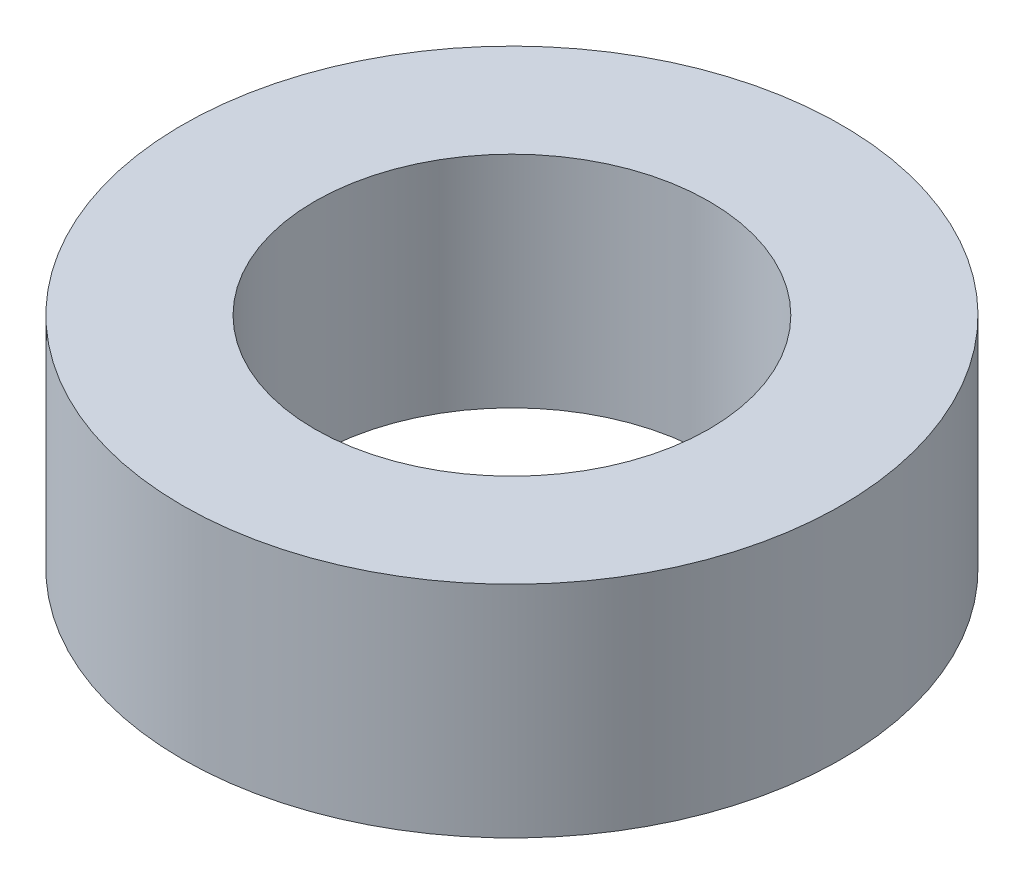
ISO-10303-21;
HEADER;
FILE_DESCRIPTION(('STEP AP214'),'2;1');
FILE_NAME('part.step','',(''),(''),'','','');
FILE_SCHEMA(('AUTOMOTIVE_DESIGN { 1 0 10303 214 1 1 1 1 }'));
ENDSEC;
DATA;
#1=APPLICATION_CONTEXT('core data for automotive mechanical design processes');
#2=APPLICATION_PROTOCOL_DEFINITION('international standard','automotive_design',2000,#1);
#3=PRODUCT_CONTEXT('',#1,'mechanical');
#4=PRODUCT('Part','Part','',(#3));
#5=PRODUCT_RELATED_PRODUCT_CATEGORY('part','',(#4));
#6=PRODUCT_DEFINITION_FORMATION('','',#4);
#7=PRODUCT_DEFINITION_CONTEXT('part definition',#1,'design');
#8=PRODUCT_DEFINITION('design','',#6,#7);
#9=PRODUCT_DEFINITION_SHAPE('','',#8);
#10=(LENGTH_UNIT() NAMED_UNIT(*) SI_UNIT(.MILLI.,.METRE.));
#11=(NAMED_UNIT(*) PLANE_ANGLE_UNIT() SI_UNIT($,.RADIAN.));
#12=(NAMED_UNIT(*) SI_UNIT($,.STERADIAN.) SOLID_ANGLE_UNIT());
#13=UNCERTAINTY_MEASURE_WITH_UNIT(LENGTH_MEASURE(1.E-05),#10,'distance_accuracy_value','');
#14=(GEOMETRIC_REPRESENTATION_CONTEXT(3) GLOBAL_UNCERTAINTY_ASSIGNED_CONTEXT((#13)) GLOBAL_UNIT_ASSIGNED_CONTEXT((#10,
#11,#12)) REPRESENTATION_CONTEXT('',''));
#15=CARTESIAN_POINT('',(0.,0.,0.));
#16=DIRECTION('',(0.,0.,1.));
#17=DIRECTION('',(1.,0.,0.));
#18=AXIS2_PLACEMENT_3D('',#15,#16,#17);
#19=CARTESIAN_POINT('',(0.,3.175,0.));
#20=DIRECTION('',(0.,1.,0.));
#21=DIRECTION('',(0.,0.,1.));
#22=AXIS2_PLACEMENT_3D('',#19,#20,#21);
#23=PLANE('',#22);
#24=CARTESIAN_POINT('',(0.,3.175,0.));
#25=DIRECTION('',(0.,1.,0.));
#26=DIRECTION('',(0.,0.,1.));
#27=AXIS2_PLACEMENT_3D('',#24,#25,#26);
#28=CIRCLE('',#27,4.7625);
#29=CARTESIAN_POINT('',(0.,3.175,4.7625));
#30=VERTEX_POINT('',#29);
#31=EDGE_CURVE('E10',#30,#30,#28,.T.);
#32=ORIENTED_EDGE('',*,*,#31,.T.);
#33=EDGE_LOOP('',(#32));
#34=FACE_BOUND('',#33,.T.);
#35=CARTESIAN_POINT('',(0.,3.175,0.));
#36=DIRECTION('',(0.,1.,0.));
#37=DIRECTION('',(0.,0.,1.));
#38=AXIS2_PLACEMENT_3D('',#35,#36,#37);
#39=CIRCLE('',#38,2.850007);
#40=CARTESIAN_POINT('',(0.,3.175,2.850007));
#41=VERTEX_POINT('',#40);
#42=EDGE_CURVE('E40',#41,#41,#39,.T.);
#43=ORIENTED_EDGE('',*,*,#42,.F.);
#44=EDGE_LOOP('',(#43));
#45=FACE_BOUND('',#44,.T.);
#46=ADVANCED_FACE('F29',(#34,#45),#23,.T.);
#47=CARTESIAN_POINT('',(0.,0.,0.));
#48=DIRECTION('',(0.,1.,0.));
#49=DIRECTION('',(0.,0.,1.));
#50=AXIS2_PLACEMENT_3D('',#47,#48,#49);
#51=PLANE('',#50);
#52=CARTESIAN_POINT('',(0.,0.,0.));
#53=DIRECTION('',(0.,1.,0.));
#54=DIRECTION('',(0.,0.,1.));
#55=AXIS2_PLACEMENT_3D('',#52,#53,#54);
#56=CIRCLE('',#55,4.7625);
#57=CARTESIAN_POINT('',(0.,0.,4.7625));
#58=VERTEX_POINT('',#57);
#59=EDGE_CURVE('E33',#58,#58,#56,.T.);
#60=ORIENTED_EDGE('',*,*,#59,.F.);
#61=EDGE_LOOP('',(#60));
#62=FACE_BOUND('',#61,.T.);
#63=CARTESIAN_POINT('',(0.,0.,0.));
#64=DIRECTION('',(0.,1.,0.));
#65=DIRECTION('',(0.,0.,1.));
#66=AXIS2_PLACEMENT_3D('',#63,#64,#65);
#67=CIRCLE('',#66,2.850007);
#68=CARTESIAN_POINT('',(0.,0.,2.850007));
#69=VERTEX_POINT('',#68);
#70=EDGE_CURVE('E42',#69,#69,#67,.T.);
#71=ORIENTED_EDGE('',*,*,#70,.T.);
#72=EDGE_LOOP('',(#71));
#73=FACE_BOUND('',#72,.T.);
#74=ADVANCED_FACE('F52',(#62,#73),#51,.F.);
#75=CARTESIAN_POINT('',(0.,3.175,0.));
#76=DIRECTION('',(0.,-1.,0.));
#77=DIRECTION('',(0.,0.,-1.));
#78=AXIS2_PLACEMENT_3D('',#75,#76,#77);
#79=CYLINDRICAL_SURFACE('',#78,4.7625);
#80=ORIENTED_EDGE('',*,*,#31,.F.);
#81=EDGE_LOOP('',(#80));
#82=FACE_BOUND('',#81,.T.);
#83=ORIENTED_EDGE('',*,*,#59,.T.);
#84=EDGE_LOOP('',(#83));
#85=FACE_BOUND('',#84,.T.);
#86=ADVANCED_FACE('F31',(#82,#85),#79,.T.);
#87=CARTESIAN_POINT('',(0.,3.175,0.));
#88=DIRECTION('',(0.,-1.,0.));
#89=DIRECTION('',(0.,0.,-1.));
#90=AXIS2_PLACEMENT_3D('',#87,#88,#89);
#91=CYLINDRICAL_SURFACE('',#90,2.850007);
#92=ORIENTED_EDGE('',*,*,#42,.T.);
#93=EDGE_LOOP('',(#92));
#94=FACE_BOUND('',#93,.T.);
#95=ORIENTED_EDGE('',*,*,#70,.F.);
#96=EDGE_LOOP('',(#95));
#97=FACE_BOUND('',#96,.T.);
#98=ADVANCED_FACE('F48',(#94,#97),#91,.F.);
#99=CLOSED_SHELL('',(#46,#74,#86,#98));
#100=MANIFOLD_SOLID_BREP('B2',#99);
#101=ADVANCED_BREP_SHAPE_REPRESENTATION('',(#18,#100),#14);
#102=SHAPE_DEFINITION_REPRESENTATION(#9,#101);
ENDSEC;
END-ISO-10303-21;
